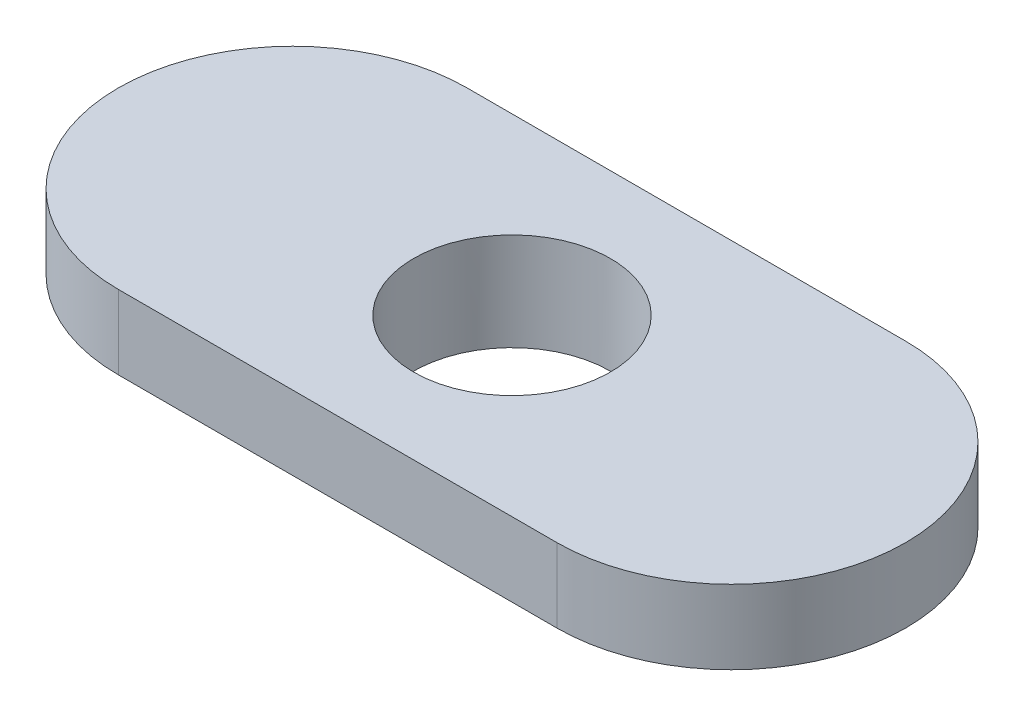
ISO-10303-21;
HEADER;
FILE_DESCRIPTION(('STEP AP214'),'2;1');
FILE_NAME('part.step','',(''),(''),'','','');
FILE_SCHEMA(('AUTOMOTIVE_DESIGN { 1 0 10303 214 1 1 1 1 }'));
ENDSEC;
DATA;
#1=APPLICATION_CONTEXT('core data for automotive mechanical design processes');
#2=APPLICATION_PROTOCOL_DEFINITION('international standard','automotive_design',2000,#1);
#3=PRODUCT_CONTEXT('',#1,'mechanical');
#4=PRODUCT('Part','Part','',(#3));
#5=PRODUCT_RELATED_PRODUCT_CATEGORY('part','',(#4));
#6=PRODUCT_DEFINITION_FORMATION('','',#4);
#7=PRODUCT_DEFINITION_CONTEXT('part definition',#1,'design');
#8=PRODUCT_DEFINITION('design','',#6,#7);
#9=PRODUCT_DEFINITION_SHAPE('','',#8);
#10=(LENGTH_UNIT() NAMED_UNIT(*) SI_UNIT(.MILLI.,.METRE.));
#11=(NAMED_UNIT(*) PLANE_ANGLE_UNIT() SI_UNIT($,.RADIAN.));
#12=(NAMED_UNIT(*) SI_UNIT($,.STERADIAN.) SOLID_ANGLE_UNIT());
#13=UNCERTAINTY_MEASURE_WITH_UNIT(LENGTH_MEASURE(1.E-05),#10,'distance_accuracy_value','');
#14=(GEOMETRIC_REPRESENTATION_CONTEXT(3) GLOBAL_UNCERTAINTY_ASSIGNED_CONTEXT((#13)) GLOBAL_UNIT_ASSIGNED_CONTEXT((#10,
#11,#12)) REPRESENTATION_CONTEXT('',''));
#15=CARTESIAN_POINT('',(0.,0.,0.));
#16=DIRECTION('',(0.,0.,1.));
#17=DIRECTION('',(1.,0.,0.));
#18=AXIS2_PLACEMENT_3D('',#15,#16,#17);
#19=CARTESIAN_POINT('',(-7.0739,-8.7376,0.));
#20=DIRECTION('',(0.,1.,0.));
#21=DIRECTION('',(0.,0.,1.));
#22=AXIS2_PLACEMENT_3D('',#19,#20,#21);
#23=PLANE('',#22);
#24=CARTESIAN_POINT('',(-7.0739,-8.7376,0.));
#25=DIRECTION('',(0.,1.,0.));
#26=DIRECTION('',(0.,0.,1.));
#27=AXIS2_PLACEMENT_3D('',#24,#25,#26);
#28=CIRCLE('',#27,5.6261);
#29=CARTESIAN_POINT('',(-7.0739,-8.7376,-5.6261));
#30=VERTEX_POINT('',#29);
#31=CARTESIAN_POINT('',(-7.0739,-8.7376,5.6261));
#32=VERTEX_POINT('',#31);
#33=EDGE_CURVE('E93',#30,#32,#28,.T.);
#34=ORIENTED_EDGE('',*,*,#33,.F.);
#35=DIRECTION('',(-1.,0.,0.));
#36=VECTOR('',#35,1.);
#37=CARTESIAN_POINT('',(-7.0739,-8.7376,-5.6261));
#38=LINE('',#37,#36);
#39=CARTESIAN_POINT('',(7.0739,-8.7376,-5.6261));
#40=VERTEX_POINT('',#39);
#41=EDGE_CURVE('E90',#40,#30,#38,.T.);
#42=ORIENTED_EDGE('',*,*,#41,.F.);
#43=CARTESIAN_POINT('',(7.0739,-8.7376,0.));
#44=DIRECTION('',(0.,1.,0.));
#45=DIRECTION('',(0.,0.,1.));
#46=AXIS2_PLACEMENT_3D('',#43,#44,#45);
#47=CIRCLE('',#46,5.6261);
#48=CARTESIAN_POINT('',(7.0739,-8.7376,5.6261));
#49=VERTEX_POINT('',#48);
#50=EDGE_CURVE('E82',#49,#40,#47,.T.);
#51=ORIENTED_EDGE('',*,*,#50,.F.);
#52=DIRECTION('',(1.,0.,0.));
#53=VECTOR('',#52,1.);
#54=CARTESIAN_POINT('',(-7.0739,-8.7376,5.6261));
#55=LINE('',#54,#53);
#56=EDGE_CURVE('E89',#32,#49,#55,.T.);
#57=ORIENTED_EDGE('',*,*,#56,.F.);
#58=EDGE_LOOP('',(#34,#42,#51,#57));
#59=FACE_BOUND('',#58,.T.);
#60=CARTESIAN_POINT('',(0.,-8.7376,0.));
#61=DIRECTION('',(0.,1.,0.));
#62=DIRECTION('',(0.,0.,1.));
#63=AXIS2_PLACEMENT_3D('',#60,#61,#62);
#64=CIRCLE('',#63,3.5687);
#65=CARTESIAN_POINT('',(0.,-8.7376,3.5687));
#66=VERTEX_POINT('',#65);
#67=EDGE_CURVE('E11',#66,#66,#64,.F.);
#68=ORIENTED_EDGE('',*,*,#67,.F.);
#69=EDGE_LOOP('',(#68));
#70=FACE_BOUND('',#69,.T.);
#71=ADVANCED_FACE('F32',(#59,#70),#23,.F.);
#72=CARTESIAN_POINT('',(-7.0739,-8.7376,0.));
#73=DIRECTION('',(0.,1.,0.));
#74=DIRECTION('',(0.,0.,1.));
#75=AXIS2_PLACEMENT_3D('',#72,#73,#74);
#76=CYLINDRICAL_SURFACE('',#75,5.6261);
#77=CARTESIAN_POINT('',(-7.0739,-6.35,0.));
#78=DIRECTION('',(0.,1.,0.));
#79=DIRECTION('',(0.,0.,1.));
#80=AXIS2_PLACEMENT_3D('',#77,#78,#79);
#81=CIRCLE('',#80,5.6261);
#82=CARTESIAN_POINT('',(-7.0739,-6.35,-5.6261));
#83=VERTEX_POINT('',#82);
#84=CARTESIAN_POINT('',(-7.0739,-6.35,5.6261));
#85=VERTEX_POINT('',#84);
#86=EDGE_CURVE('E100',#83,#85,#81,.T.);
#87=ORIENTED_EDGE('',*,*,#86,.F.);
#88=DIRECTION('',(0.,1.,0.));
#89=VECTOR('',#88,1.);
#90=CARTESIAN_POINT('',(-7.0739,-8.7376,-5.6261));
#91=LINE('',#90,#89);
#92=EDGE_CURVE('E41',#30,#83,#91,.T.);
#93=ORIENTED_EDGE('',*,*,#92,.F.);
#94=ORIENTED_EDGE('',*,*,#33,.T.);
#95=DIRECTION('',(0.,1.,0.));
#96=VECTOR('',#95,1.);
#97=CARTESIAN_POINT('',(-7.0739,-8.7376,5.6261));
#98=LINE('',#97,#96);
#99=EDGE_CURVE('E76',#32,#85,#98,.T.);
#100=ORIENTED_EDGE('',*,*,#99,.T.);
#101=EDGE_LOOP('',(#87,#93,#94,#100));
#102=FACE_BOUND('',#101,.T.);
#103=ADVANCED_FACE('F34',(#102),#76,.T.);
#104=CARTESIAN_POINT('',(-7.0739,-8.7376,-5.6261));
#105=DIRECTION('',(0.,0.,-1.));
#106=DIRECTION('',(-1.,0.,0.));
#107=AXIS2_PLACEMENT_3D('',#104,#105,#106);
#108=PLANE('',#107);
#109=DIRECTION('',(-1.,0.,0.));
#110=VECTOR('',#109,1.);
#111=CARTESIAN_POINT('',(-7.0739,-6.35,-5.6261));
#112=LINE('',#111,#110);
#113=CARTESIAN_POINT('',(7.0739,-6.35,-5.6261));
#114=VERTEX_POINT('',#113);
#115=EDGE_CURVE('E95',#114,#83,#112,.T.);
#116=ORIENTED_EDGE('',*,*,#115,.F.);
#117=DIRECTION('',(0.,1.,0.));
#118=VECTOR('',#117,1.);
#119=CARTESIAN_POINT('',(7.0739,-8.7376,-5.6261));
#120=LINE('',#119,#118);
#121=EDGE_CURVE('E65',#40,#114,#120,.T.);
#122=ORIENTED_EDGE('',*,*,#121,.F.);
#123=ORIENTED_EDGE('',*,*,#41,.T.);
#124=ORIENTED_EDGE('',*,*,#92,.T.);
#125=EDGE_LOOP('',(#116,#122,#123,#124));
#126=FACE_BOUND('',#125,.T.);
#127=ADVANCED_FACE('F112',(#126),#108,.T.);
#128=CARTESIAN_POINT('',(7.0739,-8.7376,0.));
#129=DIRECTION('',(0.,1.,0.));
#130=DIRECTION('',(0.,0.,1.));
#131=AXIS2_PLACEMENT_3D('',#128,#129,#130);
#132=CYLINDRICAL_SURFACE('',#131,5.6261);
#133=CARTESIAN_POINT('',(7.0739,-6.35,0.));
#134=DIRECTION('',(0.,1.,0.));
#135=DIRECTION('',(0.,0.,1.));
#136=AXIS2_PLACEMENT_3D('',#133,#134,#135);
#137=CIRCLE('',#136,5.6261);
#138=CARTESIAN_POINT('',(7.0739,-6.35,5.6261));
#139=VERTEX_POINT('',#138);
#140=EDGE_CURVE('E84',#139,#114,#137,.T.);
#141=ORIENTED_EDGE('',*,*,#140,.F.);
#142=DIRECTION('',(0.,1.,0.));
#143=VECTOR('',#142,1.);
#144=CARTESIAN_POINT('',(7.0739,-8.7376,5.6261));
#145=LINE('',#144,#143);
#146=EDGE_CURVE('E79',#49,#139,#145,.T.);
#147=ORIENTED_EDGE('',*,*,#146,.F.);
#148=ORIENTED_EDGE('',*,*,#50,.T.);
#149=ORIENTED_EDGE('',*,*,#121,.T.);
#150=EDGE_LOOP('',(#141,#147,#148,#149));
#151=FACE_BOUND('',#150,.T.);
#152=ADVANCED_FACE('F81',(#151),#132,.T.);
#153=CARTESIAN_POINT('',(-7.0739,-8.7376,5.6261));
#154=DIRECTION('',(0.,0.,1.));
#155=DIRECTION('',(1.,0.,0.));
#156=AXIS2_PLACEMENT_3D('',#153,#154,#155);
#157=PLANE('',#156);
#158=DIRECTION('',(1.,0.,0.));
#159=VECTOR('',#158,1.);
#160=CARTESIAN_POINT('',(-7.0739,-6.35,5.6261));
#161=LINE('',#160,#159);
#162=EDGE_CURVE('E103',#85,#139,#161,.T.);
#163=ORIENTED_EDGE('',*,*,#162,.F.);
#164=ORIENTED_EDGE('',*,*,#99,.F.);
#165=ORIENTED_EDGE('',*,*,#56,.T.);
#166=ORIENTED_EDGE('',*,*,#146,.T.);
#167=EDGE_LOOP('',(#163,#164,#165,#166));
#168=FACE_BOUND('',#167,.T.);
#169=ADVANCED_FACE('F92',(#168),#157,.T.);
#170=CARTESIAN_POINT('',(-7.0739,-6.35,0.));
#171=DIRECTION('',(0.,1.,0.));
#172=DIRECTION('',(0.,0.,1.));
#173=AXIS2_PLACEMENT_3D('',#170,#171,#172);
#174=PLANE('',#173);
#175=CARTESIAN_POINT('',(0.,-6.35,0.));
#176=DIRECTION('',(0.,1.,0.));
#177=DIRECTION('',(0.,0.,1.));
#178=AXIS2_PLACEMENT_3D('',#175,#176,#177);
#179=CIRCLE('',#178,3.175);
#180=CARTESIAN_POINT('',(0.,-6.35,3.175));
#181=VERTEX_POINT('',#180);
#182=EDGE_CURVE('E104',#181,#181,#179,.T.);
#183=ORIENTED_EDGE('',*,*,#182,.F.);
#184=EDGE_LOOP('',(#183));
#185=FACE_BOUND('',#184,.T.);
#186=ORIENTED_EDGE('',*,*,#86,.T.);
#187=ORIENTED_EDGE('',*,*,#162,.T.);
#188=ORIENTED_EDGE('',*,*,#140,.T.);
#189=ORIENTED_EDGE('',*,*,#115,.T.);
#190=EDGE_LOOP('',(#186,#187,#188,#189));
#191=FACE_BOUND('',#190,.T.);
#192=ADVANCED_FACE('F111',(#185,#191),#174,.T.);
#193=CARTESIAN_POINT('',(0.,-8.7376,0.));
#194=DIRECTION('',(0.,1.,0.));
#195=DIRECTION('',(0.,0.,1.));
#196=AXIS2_PLACEMENT_3D('',#193,#194,#195);
#197=CYLINDRICAL_SURFACE('',#196,3.175);
#198=ORIENTED_EDGE('',*,*,#182,.T.);
#199=EDGE_LOOP('',(#198));
#200=FACE_BOUND('',#199,.T.);
#201=CARTESIAN_POINT('',(0.,-9.4996,0.));
#202=DIRECTION('',(0.,-1.,0.));
#203=DIRECTION('',(0.,0.,-1.));
#204=AXIS2_PLACEMENT_3D('',#201,#202,#203);
#205=CIRCLE('',#204,3.175);
#206=CARTESIAN_POINT('',(0.,-9.4996,-3.175));
#207=VERTEX_POINT('',#206);
#208=EDGE_CURVE('E140',#207,#207,#205,.T.);
#209=ORIENTED_EDGE('',*,*,#208,.T.);
#210=EDGE_LOOP('',(#209));
#211=FACE_BOUND('',#210,.T.);
#212=ADVANCED_FACE('F126',(#200,#211),#197,.F.);
#213=CARTESIAN_POINT('',(0.,-9.4996,0.));
#214=DIRECTION('',(0.,-1.,0.));
#215=DIRECTION('',(0.,0.,-1.));
#216=AXIS2_PLACEMENT_3D('',#213,#214,#215);
#217=PLANE('',#216);
#218=CARTESIAN_POINT('',(0.,-9.4996,0.));
#219=DIRECTION('',(0.,-1.,0.));
#220=DIRECTION('',(0.,0.,-1.));
#221=AXIS2_PLACEMENT_3D('',#218,#219,#220);
#222=CIRCLE('',#221,3.5687);
#223=CARTESIAN_POINT('',(0.,-9.4996,-3.5687));
#224=VERTEX_POINT('',#223);
#225=EDGE_CURVE('E138',#224,#224,#222,.T.);
#226=ORIENTED_EDGE('',*,*,#225,.T.);
#227=EDGE_LOOP('',(#226));
#228=FACE_BOUND('',#227,.T.);
#229=ORIENTED_EDGE('',*,*,#208,.F.);
#230=EDGE_LOOP('',(#229));
#231=FACE_BOUND('',#230,.T.);
#232=ADVANCED_FACE('F134',(#228,#231),#217,.T.);
#233=CARTESIAN_POINT('',(0.,-9.4996,0.));
#234=DIRECTION('',(0.,1.,0.));
#235=DIRECTION('',(0.,0.,1.));
#236=AXIS2_PLACEMENT_3D('',#233,#234,#235);
#237=CYLINDRICAL_SURFACE('',#236,3.5687);
#238=ORIENTED_EDGE('',*,*,#225,.F.);
#239=EDGE_LOOP('',(#238));
#240=FACE_BOUND('',#239,.T.);
#241=ORIENTED_EDGE('',*,*,#67,.T.);
#242=EDGE_LOOP('',(#241));
#243=FACE_BOUND('',#242,.T.);
#244=ADVANCED_FACE('F148',(#240,#243),#237,.T.);
#245=CLOSED_SHELL('',(#71,#103,#127,#152,#169,#192,#212,#232,#244));
#246=MANIFOLD_SOLID_BREP('B2',#245);
#247=ADVANCED_BREP_SHAPE_REPRESENTATION('',(#18,#246),#14);
#248=SHAPE_DEFINITION_REPRESENTATION(#9,#247);
ENDSEC;
END-ISO-10303-21;
